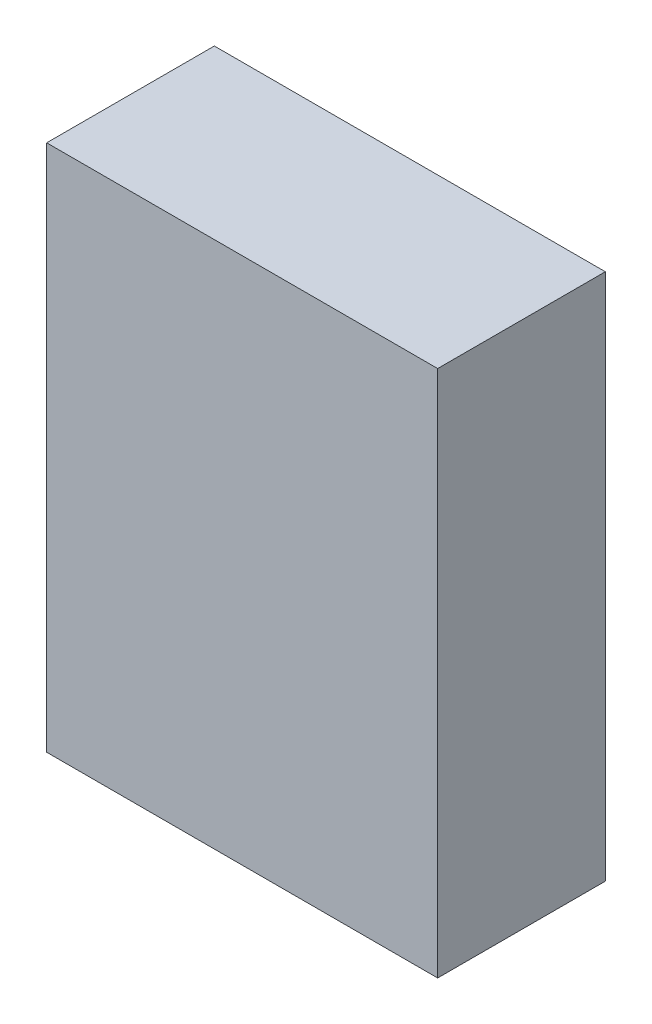
ISO-10303-21;
HEADER;
FILE_DESCRIPTION(('STEP AP214'),'2;1');
FILE_NAME('part.step','',(''),(''),'','','');
FILE_SCHEMA(('AUTOMOTIVE_DESIGN { 1 0 10303 214 1 1 1 1 }'));
ENDSEC;
DATA;
#1=APPLICATION_CONTEXT('core data for automotive mechanical design processes');
#2=APPLICATION_PROTOCOL_DEFINITION('international standard','automotive_design',2000,#1);
#3=PRODUCT_CONTEXT('',#1,'mechanical');
#4=PRODUCT('Part','Part','',(#3));
#5=PRODUCT_RELATED_PRODUCT_CATEGORY('part','',(#4));
#6=PRODUCT_DEFINITION_FORMATION('','',#4);
#7=PRODUCT_DEFINITION_CONTEXT('part definition',#1,'design');
#8=PRODUCT_DEFINITION('design','',#6,#7);
#9=PRODUCT_DEFINITION_SHAPE('','',#8);
#10=(LENGTH_UNIT() NAMED_UNIT(*) SI_UNIT(.MILLI.,.METRE.));
#11=(NAMED_UNIT(*) PLANE_ANGLE_UNIT() SI_UNIT($,.RADIAN.));
#12=(NAMED_UNIT(*) SI_UNIT($,.STERADIAN.) SOLID_ANGLE_UNIT());
#13=UNCERTAINTY_MEASURE_WITH_UNIT(LENGTH_MEASURE(1.E-05),#10,'distance_accuracy_value','');
#14=(GEOMETRIC_REPRESENTATION_CONTEXT(3) GLOBAL_UNCERTAINTY_ASSIGNED_CONTEXT((#13)) GLOBAL_UNIT_ASSIGNED_CONTEXT((#10,
#11,#12)) REPRESENTATION_CONTEXT('',''));
#15=CARTESIAN_POINT('',(0.,0.,0.));
#16=DIRECTION('',(0.,0.,1.));
#17=DIRECTION('',(1.,0.,0.));
#18=AXIS2_PLACEMENT_3D('',#15,#16,#17);
#19=CARTESIAN_POINT('',(-0.87448898,1.18051072,0.));
#20=DIRECTION('',(0.,1.,0.));
#21=DIRECTION('',(1.,0.,0.));
#22=AXIS2_PLACEMENT_3D('',#19,#20,#21);
#23=PLANE('',#22);
#24=DIRECTION('',(0.,0.,1.));
#25=VECTOR('',#24,1.);
#26=CARTESIAN_POINT('',(-0.87448898,1.18051072,0.));
#27=LINE('',#26,#25);
#28=CARTESIAN_POINT('',(-0.87448898,1.18051072,0.));
#29=VERTEX_POINT('',#28);
#30=CARTESIAN_POINT('',(-0.87448898,1.18051072,0.75000104));
#31=VERTEX_POINT('',#30);
#32=EDGE_CURVE('E11',#29,#31,#27,.T.);
#33=ORIENTED_EDGE('',*,*,#32,.T.);
#34=DIRECTION('',(1.,0.,0.));
#35=VECTOR('',#34,1.);
#36=CARTESIAN_POINT('',(-0.87448898,1.18051072,0.75000104));
#37=LINE('',#36,#35);
#38=CARTESIAN_POINT('',(0.87449152,1.18051072,0.75000104));
#39=VERTEX_POINT('',#38);
#40=EDGE_CURVE('E23',#31,#39,#37,.T.);
#41=ORIENTED_EDGE('',*,*,#40,.T.);
#42=DIRECTION('',(0.,0.,1.));
#43=VECTOR('',#42,1.);
#44=CARTESIAN_POINT('',(0.87449152,1.18051072,0.));
#45=LINE('',#44,#43);
#46=CARTESIAN_POINT('',(0.87449152,1.18051072,0.));
#47=VERTEX_POINT('',#46);
#48=EDGE_CURVE('E84',#47,#39,#45,.T.);
#49=ORIENTED_EDGE('',*,*,#48,.F.);
#50=DIRECTION('',(1.,0.,0.));
#51=VECTOR('',#50,1.);
#52=CARTESIAN_POINT('',(-0.87448898,1.18051072,0.));
#53=LINE('',#52,#51);
#54=EDGE_CURVE('E82',#29,#47,#53,.T.);
#55=ORIENTED_EDGE('',*,*,#54,.F.);
#56=EDGE_LOOP('',(#33,#41,#49,#55));
#57=FACE_BOUND('',#56,.T.);
#58=ADVANCED_FACE('F16',(#57),#23,.T.);
#59=CARTESIAN_POINT('',(0.87449152,1.18051072,0.));
#60=DIRECTION('',(1.,0.,0.));
#61=DIRECTION('',(0.,-1.,0.));
#62=AXIS2_PLACEMENT_3D('',#59,#60,#61);
#63=PLANE('',#62);
#64=ORIENTED_EDGE('',*,*,#48,.T.);
#65=DIRECTION('',(0.,-1.,0.));
#66=VECTOR('',#65,1.);
#67=CARTESIAN_POINT('',(0.87449152,1.18051072,0.75000104));
#68=LINE('',#67,#66);
#69=CARTESIAN_POINT('',(0.87449152,-1.18050818,0.75000104));
#70=VERTEX_POINT('',#69);
#71=EDGE_CURVE('E80',#39,#70,#68,.T.);
#72=ORIENTED_EDGE('',*,*,#71,.T.);
#73=DIRECTION('',(0.,0.,1.));
#74=VECTOR('',#73,1.);
#75=CARTESIAN_POINT('',(0.87449152,-1.18050818,0.));
#76=LINE('',#75,#74);
#77=CARTESIAN_POINT('',(0.87449152,-1.18050818,0.));
#78=VERTEX_POINT('',#77);
#79=EDGE_CURVE('E78',#78,#70,#76,.T.);
#80=ORIENTED_EDGE('',*,*,#79,.F.);
#81=DIRECTION('',(0.,-1.,0.));
#82=VECTOR('',#81,1.);
#83=CARTESIAN_POINT('',(0.87449152,1.18051072,0.));
#84=LINE('',#83,#82);
#85=EDGE_CURVE('E69',#47,#78,#84,.T.);
#86=ORIENTED_EDGE('',*,*,#85,.F.);
#87=EDGE_LOOP('',(#64,#72,#80,#86));
#88=FACE_BOUND('',#87,.T.);
#89=ADVANCED_FACE('F89',(#88),#63,.T.);
#90=CARTESIAN_POINT('',(0.87449152,-1.18050818,0.));
#91=DIRECTION('',(-1.45227462341292E-06,-0.999999999998946,0.));
#92=DIRECTION('',(-0.999999999998946,1.45227462341292E-06,0.));
#93=AXIS2_PLACEMENT_3D('',#90,#91,#92);
#94=PLANE('',#93);
#95=ORIENTED_EDGE('',*,*,#79,.T.);
#96=DIRECTION('',(-0.999999999998946,1.45227462341292E-06,0.));
#97=VECTOR('',#96,1.);
#98=CARTESIAN_POINT('',(0.87449152,-1.18050818,0.75000104));
#99=LINE('',#98,#97);
#100=CARTESIAN_POINT('',(-0.87448898,-1.18050564,0.75000104));
#101=VERTEX_POINT('',#100);
#102=EDGE_CURVE('E59',#70,#101,#99,.T.);
#103=ORIENTED_EDGE('',*,*,#102,.T.);
#104=DIRECTION('',(0.,0.,1.));
#105=VECTOR('',#104,1.);
#106=CARTESIAN_POINT('',(-0.87448898,-1.18050564,0.));
#107=LINE('',#106,#105);
#108=CARTESIAN_POINT('',(-0.87448898,-1.18050564,0.));
#109=VERTEX_POINT('',#108);
#110=EDGE_CURVE('E53',#109,#101,#107,.T.);
#111=ORIENTED_EDGE('',*,*,#110,.F.);
#112=DIRECTION('',(-0.999999999998946,1.45227462341292E-06,0.));
#113=VECTOR('',#112,1.);
#114=CARTESIAN_POINT('',(0.87449152,-1.18050818,0.));
#115=LINE('',#114,#113);
#116=EDGE_CURVE('E57',#78,#109,#115,.T.);
#117=ORIENTED_EDGE('',*,*,#116,.F.);
#118=EDGE_LOOP('',(#95,#103,#111,#117));
#119=FACE_BOUND('',#118,.T.);
#120=ADVANCED_FACE('F56',(#119),#94,.T.);
#121=CARTESIAN_POINT('',(-0.87448898,-1.18050564,0.));
#122=DIRECTION('',(-1.,0.,0.));
#123=DIRECTION('',(0.,1.,0.));
#124=AXIS2_PLACEMENT_3D('',#121,#122,#123);
#125=PLANE('',#124);
#126=ORIENTED_EDGE('',*,*,#110,.T.);
#127=DIRECTION('',(0.,1.,0.));
#128=VECTOR('',#127,1.);
#129=CARTESIAN_POINT('',(-0.87448898,-1.18050564,0.75000104));
#130=LINE('',#129,#128);
#131=EDGE_CURVE('E70',#101,#31,#130,.T.);
#132=ORIENTED_EDGE('',*,*,#131,.T.);
#133=ORIENTED_EDGE('',*,*,#32,.F.);
#134=DIRECTION('',(0.,1.,0.));
#135=VECTOR('',#134,1.);
#136=CARTESIAN_POINT('',(-0.87448898,-1.18050564,0.));
#137=LINE('',#136,#135);
#138=EDGE_CURVE('E67',#109,#29,#137,.T.);
#139=ORIENTED_EDGE('',*,*,#138,.F.);
#140=EDGE_LOOP('',(#126,#132,#133,#139));
#141=FACE_BOUND('',#140,.T.);
#142=ADVANCED_FACE('F72',(#141),#125,.T.);
#143=CARTESIAN_POINT('',(-0.87448898,1.18051072,0.));
#144=DIRECTION('',(0.,0.,1.));
#145=DIRECTION('',(1.,0.,0.));
#146=AXIS2_PLACEMENT_3D('',#143,#144,#145);
#147=PLANE('',#146);
#148=ORIENTED_EDGE('',*,*,#54,.T.);
#149=ORIENTED_EDGE('',*,*,#85,.T.);
#150=ORIENTED_EDGE('',*,*,#116,.T.);
#151=ORIENTED_EDGE('',*,*,#138,.T.);
#152=EDGE_LOOP('',(#148,#149,#150,#151));
#153=FACE_BOUND('',#152,.T.);
#154=ADVANCED_FACE('F66',(#153),#147,.F.);
#155=CARTESIAN_POINT('',(-0.87448898,1.18051072,0.75000104));
#156=DIRECTION('',(0.,0.,1.));
#157=DIRECTION('',(1.,0.,0.));
#158=AXIS2_PLACEMENT_3D('',#155,#156,#157);
#159=PLANE('',#158);
#160=ORIENTED_EDGE('',*,*,#131,.F.);
#161=ORIENTED_EDGE('',*,*,#102,.F.);
#162=ORIENTED_EDGE('',*,*,#71,.F.);
#163=ORIENTED_EDGE('',*,*,#40,.F.);
#164=EDGE_LOOP('',(#160,#161,#162,#163));
#165=FACE_BOUND('',#164,.T.);
#166=ADVANCED_FACE('F90',(#165),#159,.T.);
#167=CLOSED_SHELL('',(#58,#89,#120,#142,#154,#166));
#168=MANIFOLD_SOLID_BREP('B1',#167);
#169=ADVANCED_BREP_SHAPE_REPRESENTATION('',(#18,#168),#14);
#170=SHAPE_DEFINITION_REPRESENTATION(#9,#169);
ENDSEC;
END-ISO-10303-21;
